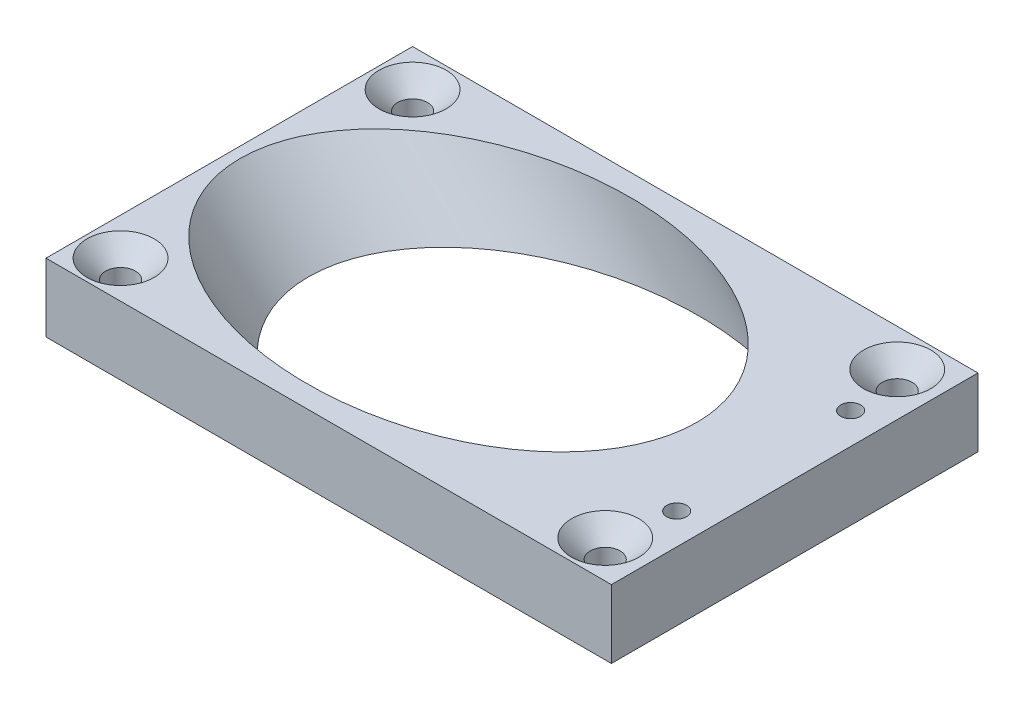
ISO-10303-21;
HEADER;
FILE_DESCRIPTION(('STEP AP214'),'2;1');
FILE_NAME('part.step','',(''),(''),'','','');
FILE_SCHEMA(('AUTOMOTIVE_DESIGN { 1 0 10303 214 1 1 1 1 }'));
ENDSEC;
DATA;
#1=APPLICATION_CONTEXT('core data for automotive mechanical design processes');
#2=APPLICATION_PROTOCOL_DEFINITION('international standard','automotive_design',2000,#1);
#3=PRODUCT_CONTEXT('',#1,'mechanical');
#4=PRODUCT('Part','Part','',(#3));
#5=PRODUCT_RELATED_PRODUCT_CATEGORY('part','',(#4));
#6=PRODUCT_DEFINITION_FORMATION('','',#4);
#7=PRODUCT_DEFINITION_CONTEXT('part definition',#1,'design');
#8=PRODUCT_DEFINITION('design','',#6,#7);
#9=PRODUCT_DEFINITION_SHAPE('','',#8);
#10=(LENGTH_UNIT() NAMED_UNIT(*) SI_UNIT(.MILLI.,.METRE.));
#11=(NAMED_UNIT(*) PLANE_ANGLE_UNIT() SI_UNIT($,.RADIAN.));
#12=(NAMED_UNIT(*) SI_UNIT($,.STERADIAN.) SOLID_ANGLE_UNIT());
#13=UNCERTAINTY_MEASURE_WITH_UNIT(LENGTH_MEASURE(1.E-05),#10,'distance_accuracy_value','');
#14=(GEOMETRIC_REPRESENTATION_CONTEXT(3) GLOBAL_UNCERTAINTY_ASSIGNED_CONTEXT((#13)) GLOBAL_UNIT_ASSIGNED_CONTEXT((#10,
#11,#12)) REPRESENTATION_CONTEXT('',''));
#15=CARTESIAN_POINT('',(0.,0.,0.));
#16=DIRECTION('',(0.,0.,1.));
#17=DIRECTION('',(1.,0.,0.));
#18=AXIS2_PLACEMENT_3D('',#15,#16,#17);
#19=CARTESIAN_POINT('',(22.75,5.5,14.75));
#20=DIRECTION('',(-1.,0.,0.));
#21=DIRECTION('',(0.,0.,1.));
#22=AXIS2_PLACEMENT_3D('',#19,#20,#21);
#23=PLANE('',#22);
#24=DIRECTION('',(0.,0.,-1.));
#25=VECTOR('',#24,1.);
#26=CARTESIAN_POINT('',(22.75,0.,14.75));
#27=LINE('',#26,#25);
#28=CARTESIAN_POINT('',(22.75,0.,14.75));
#29=VERTEX_POINT('',#28);
#30=CARTESIAN_POINT('',(22.75,0.,-14.75));
#31=VERTEX_POINT('',#30);
#32=EDGE_CURVE('E101',#29,#31,#27,.T.);
#33=ORIENTED_EDGE('',*,*,#32,.T.);
#34=DIRECTION('',(0.,-1.,0.));
#35=VECTOR('',#34,1.);
#36=CARTESIAN_POINT('',(22.75,5.5,-14.75));
#37=LINE('',#36,#35);
#38=CARTESIAN_POINT('',(22.75,5.5,-14.75));
#39=VERTEX_POINT('',#38);
#40=EDGE_CURVE('E11',#39,#31,#37,.T.);
#41=ORIENTED_EDGE('',*,*,#40,.F.);
#42=DIRECTION('',(0.,0.,-1.));
#43=VECTOR('',#42,1.);
#44=CARTESIAN_POINT('',(22.75,5.5,14.75));
#45=LINE('',#44,#43);
#46=CARTESIAN_POINT('',(22.75,5.5,14.75));
#47=VERTEX_POINT('',#46);
#48=EDGE_CURVE('E89',#47,#39,#45,.T.);
#49=ORIENTED_EDGE('',*,*,#48,.F.);
#50=DIRECTION('',(0.,-1.,0.));
#51=VECTOR('',#50,1.);
#52=CARTESIAN_POINT('',(22.75,5.5,14.75));
#53=LINE('',#52,#51);
#54=EDGE_CURVE('E97',#47,#29,#53,.T.);
#55=ORIENTED_EDGE('',*,*,#54,.T.);
#56=EDGE_LOOP('',(#33,#41,#49,#55));
#57=FACE_BOUND('',#56,.T.);
#58=ADVANCED_FACE('F38',(#57),#23,.F.);
#59=CARTESIAN_POINT('',(-22.75,5.5,-14.75));
#60=DIRECTION('',(0.,0.,1.));
#61=DIRECTION('',(1.,0.,0.));
#62=AXIS2_PLACEMENT_3D('',#59,#60,#61);
#63=PLANE('',#62);
#64=DIRECTION('',(-1.,0.,0.));
#65=VECTOR('',#64,1.);
#66=CARTESIAN_POINT('',(-22.75,0.,-14.75));
#67=LINE('',#66,#65);
#68=CARTESIAN_POINT('',(-22.75,0.,-14.75));
#69=VERTEX_POINT('',#68);
#70=EDGE_CURVE('E93',#31,#69,#67,.T.);
#71=ORIENTED_EDGE('',*,*,#70,.T.);
#72=DIRECTION('',(0.,-1.,0.));
#73=VECTOR('',#72,1.);
#74=CARTESIAN_POINT('',(-22.75,5.5,-14.75));
#75=LINE('',#74,#73);
#76=CARTESIAN_POINT('',(-22.75,5.5,-14.75));
#77=VERTEX_POINT('',#76);
#78=EDGE_CURVE('E46',#77,#69,#75,.T.);
#79=ORIENTED_EDGE('',*,*,#78,.F.);
#80=DIRECTION('',(-1.,0.,0.));
#81=VECTOR('',#80,1.);
#82=CARTESIAN_POINT('',(-22.75,5.5,-14.75));
#83=LINE('',#82,#81);
#84=EDGE_CURVE('E84',#39,#77,#83,.T.);
#85=ORIENTED_EDGE('',*,*,#84,.F.);
#86=ORIENTED_EDGE('',*,*,#40,.T.);
#87=EDGE_LOOP('',(#71,#79,#85,#86));
#88=FACE_BOUND('',#87,.T.);
#89=ADVANCED_FACE('F92',(#88),#63,.F.);
#90=CARTESIAN_POINT('',(-22.75,5.5,14.75));
#91=DIRECTION('',(1.,0.,0.));
#92=DIRECTION('',(0.,0.,-1.));
#93=AXIS2_PLACEMENT_3D('',#90,#91,#92);
#94=PLANE('',#93);
#95=DIRECTION('',(0.,0.,1.));
#96=VECTOR('',#95,1.);
#97=CARTESIAN_POINT('',(-22.75,0.,14.75));
#98=LINE('',#97,#96);
#99=CARTESIAN_POINT('',(-22.75,0.,14.75));
#100=VERTEX_POINT('',#99);
#101=EDGE_CURVE('E71',#69,#100,#98,.T.);
#102=ORIENTED_EDGE('',*,*,#101,.T.);
#103=DIRECTION('',(0.,-1.,0.));
#104=VECTOR('',#103,1.);
#105=CARTESIAN_POINT('',(-22.75,5.5,14.75));
#106=LINE('',#105,#104);
#107=CARTESIAN_POINT('',(-22.75,5.5,14.75));
#108=VERTEX_POINT('',#107);
#109=EDGE_CURVE('E94',#108,#100,#106,.T.);
#110=ORIENTED_EDGE('',*,*,#109,.F.);
#111=DIRECTION('',(0.,0.,1.));
#112=VECTOR('',#111,1.);
#113=CARTESIAN_POINT('',(-22.75,5.5,14.75));
#114=LINE('',#113,#112);
#115=EDGE_CURVE('E87',#77,#108,#114,.T.);
#116=ORIENTED_EDGE('',*,*,#115,.F.);
#117=ORIENTED_EDGE('',*,*,#78,.T.);
#118=EDGE_LOOP('',(#102,#110,#116,#117));
#119=FACE_BOUND('',#118,.T.);
#120=ADVANCED_FACE('F95',(#119),#94,.F.);
#121=CARTESIAN_POINT('',(-22.75,5.5,14.75));
#122=DIRECTION('',(0.,0.,-1.));
#123=DIRECTION('',(-1.,0.,0.));
#124=AXIS2_PLACEMENT_3D('',#121,#122,#123);
#125=PLANE('',#124);
#126=DIRECTION('',(1.,0.,0.));
#127=VECTOR('',#126,1.);
#128=CARTESIAN_POINT('',(-22.75,0.,14.75));
#129=LINE('',#128,#127);
#130=EDGE_CURVE('E77',#100,#29,#129,.T.);
#131=ORIENTED_EDGE('',*,*,#130,.T.);
#132=ORIENTED_EDGE('',*,*,#54,.F.);
#133=DIRECTION('',(1.,0.,0.));
#134=VECTOR('',#133,1.);
#135=CARTESIAN_POINT('',(-22.75,5.5,14.75));
#136=LINE('',#135,#134);
#137=EDGE_CURVE('E54',#108,#47,#136,.T.);
#138=ORIENTED_EDGE('',*,*,#137,.F.);
#139=ORIENTED_EDGE('',*,*,#109,.T.);
#140=EDGE_LOOP('',(#131,#132,#138,#139));
#141=FACE_BOUND('',#140,.T.);
#142=ADVANCED_FACE('F109',(#141),#125,.F.);
#143=CARTESIAN_POINT('',(0.,5.5,0.));
#144=DIRECTION('',(0.,-1.,0.));
#145=DIRECTION('',(0.,0.,-1.));
#146=AXIS2_PLACEMENT_3D('',#143,#144,#145);
#147=PLANE('',#146);
#148=CARTESIAN_POINT('',(20.25,5.5,-7.));
#149=DIRECTION('',(0.,1.,0.));
#150=DIRECTION('',(0.,0.,1.));
#151=AXIS2_PLACEMENT_3D('',#148,#149,#150);
#152=CIRCLE('',#151,0.799999999999988);
#153=CARTESIAN_POINT('',(20.25,5.5,-6.20000000000001));
#154=VERTEX_POINT('',#153);
#155=EDGE_CURVE('E165',#154,#154,#152,.T.);
#156=ORIENTED_EDGE('',*,*,#155,.F.);
#157=EDGE_LOOP('',(#156));
#158=FACE_BOUND('',#157,.T.);
#159=CARTESIAN_POINT('',(20.25,5.5,7.));
#160=DIRECTION('',(0.,1.,0.));
#161=DIRECTION('',(0.,0.,1.));
#162=AXIS2_PLACEMENT_3D('',#159,#160,#161);
#163=CIRCLE('',#162,0.799999999999988);
#164=CARTESIAN_POINT('',(20.25,5.5,7.79999999999999));
#165=VERTEX_POINT('',#164);
#166=EDGE_CURVE('E159',#165,#165,#163,.T.);
#167=ORIENTED_EDGE('',*,*,#166,.F.);
#168=EDGE_LOOP('',(#167));
#169=FACE_BOUND('',#168,.T.);
#170=CARTESIAN_POINT('',(-19.75,5.5,-11.75));
#171=DIRECTION('',(0.,1.,0.));
#172=DIRECTION('',(0.,0.,1.));
#173=AXIS2_PLACEMENT_3D('',#170,#171,#172);
#174=CIRCLE('',#173,2.7);
#175=CARTESIAN_POINT('',(-19.75,5.5,-9.05));
#176=VERTEX_POINT('',#175);
#177=EDGE_CURVE('E153',#176,#176,#174,.T.);
#178=ORIENTED_EDGE('',*,*,#177,.F.);
#179=EDGE_LOOP('',(#178));
#180=FACE_BOUND('',#179,.T.);
#181=CARTESIAN_POINT('',(19.25,5.5,-11.75));
#182=DIRECTION('',(0.,1.,0.));
#183=DIRECTION('',(0.,0.,1.));
#184=AXIS2_PLACEMENT_3D('',#181,#182,#183);
#185=CIRCLE('',#184,2.7);
#186=CARTESIAN_POINT('',(19.25,5.5,-9.05));
#187=VERTEX_POINT('',#186);
#188=EDGE_CURVE('E144',#187,#187,#185,.T.);
#189=ORIENTED_EDGE('',*,*,#188,.F.);
#190=EDGE_LOOP('',(#189));
#191=FACE_BOUND('',#190,.T.);
#192=CARTESIAN_POINT('',(-19.75,5.5,11.75));
#193=DIRECTION('',(0.,1.,0.));
#194=DIRECTION('',(0.,0.,1.));
#195=AXIS2_PLACEMENT_3D('',#192,#193,#194);
#196=CIRCLE('',#195,2.7);
#197=CARTESIAN_POINT('',(-19.75,5.5,14.45));
#198=VERTEX_POINT('',#197);
#199=EDGE_CURVE('E135',#198,#198,#196,.T.);
#200=ORIENTED_EDGE('',*,*,#199,.F.);
#201=EDGE_LOOP('',(#200));
#202=FACE_BOUND('',#201,.T.);
#203=CARTESIAN_POINT('',(19.25,5.5,11.75));
#204=DIRECTION('',(0.,1.,0.));
#205=DIRECTION('',(0.,0.,1.));
#206=AXIS2_PLACEMENT_3D('',#203,#204,#205);
#207=CIRCLE('',#206,2.7);
#208=CARTESIAN_POINT('',(19.25,5.5,14.45));
#209=VERTEX_POINT('',#208);
#210=EDGE_CURVE('E126',#209,#209,#207,.T.);
#211=ORIENTED_EDGE('',*,*,#210,.F.);
#212=EDGE_LOOP('',(#211));
#213=FACE_BOUND('',#212,.T.);
#214=CARTESIAN_POINT('',(-3.50126265847082,5.5,0.));
#215=DIRECTION('',(0.,-1.,0.));
#216=DIRECTION('',(-1.,0.,0.));
#217=AXIS2_PLACEMENT_3D('',#214,#215,#216);
#218=ELLIPSE('',#217,18.3847763108503,13.);
#219=CARTESIAN_POINT('',(-21.8860389693211,5.5,0.));
#220=VERTEX_POINT('',#219);
#221=EDGE_CURVE('E104',#220,#220,#218,.F.);
#222=ORIENTED_EDGE('',*,*,#221,.F.);
#223=EDGE_LOOP('',(#222));
#224=FACE_BOUND('',#223,.T.);
#225=ORIENTED_EDGE('',*,*,#48,.T.);
#226=ORIENTED_EDGE('',*,*,#84,.T.);
#227=ORIENTED_EDGE('',*,*,#115,.T.);
#228=ORIENTED_EDGE('',*,*,#137,.T.);
#229=EDGE_LOOP('',(#225,#226,#227,#228));
#230=FACE_BOUND('',#229,.T.);
#231=ADVANCED_FACE('F85',(#158,#169,#180,#191,#202,#213,#224,#230),#147,.F.);
#232=CARTESIAN_POINT('',(0.,0.,0.));
#233=DIRECTION('',(0.,-1.,0.));
#234=DIRECTION('',(0.,0.,-1.));
#235=AXIS2_PLACEMENT_3D('',#232,#233,#234);
#236=PLANE('',#235);
#237=CARTESIAN_POINT('',(20.25,0.,-7.));
#238=DIRECTION('',(0.,1.,0.));
#239=DIRECTION('',(0.,0.,1.));
#240=AXIS2_PLACEMENT_3D('',#237,#238,#239);
#241=CIRCLE('',#240,0.799999999999995);
#242=CARTESIAN_POINT('',(20.25,0.,-6.2));
#243=VERTEX_POINT('',#242);
#244=EDGE_CURVE('E162',#243,#243,#241,.T.);
#245=ORIENTED_EDGE('',*,*,#244,.T.);
#246=EDGE_LOOP('',(#245));
#247=FACE_BOUND('',#246,.T.);
#248=CARTESIAN_POINT('',(20.25,0.,7.));
#249=DIRECTION('',(0.,1.,0.));
#250=DIRECTION('',(0.,0.,1.));
#251=AXIS2_PLACEMENT_3D('',#248,#249,#250);
#252=CIRCLE('',#251,0.799999999999995);
#253=CARTESIAN_POINT('',(20.25,0.,7.8));
#254=VERTEX_POINT('',#253);
#255=EDGE_CURVE('E156',#254,#254,#252,.T.);
#256=ORIENTED_EDGE('',*,*,#255,.T.);
#257=EDGE_LOOP('',(#256));
#258=FACE_BOUND('',#257,.T.);
#259=CARTESIAN_POINT('',(-19.75,0.,-11.75));
#260=DIRECTION('',(0.,1.,0.));
#261=DIRECTION('',(0.,0.,1.));
#262=AXIS2_PLACEMENT_3D('',#259,#260,#261);
#263=CIRCLE('',#262,1.2);
#264=CARTESIAN_POINT('',(-19.75,0.,-10.55));
#265=VERTEX_POINT('',#264);
#266=EDGE_CURVE('E147',#265,#265,#263,.T.);
#267=ORIENTED_EDGE('',*,*,#266,.T.);
#268=EDGE_LOOP('',(#267));
#269=FACE_BOUND('',#268,.T.);
#270=CARTESIAN_POINT('',(19.25,0.,-11.75));
#271=DIRECTION('',(0.,1.,0.));
#272=DIRECTION('',(0.,0.,1.));
#273=AXIS2_PLACEMENT_3D('',#270,#271,#272);
#274=CIRCLE('',#273,1.2);
#275=CARTESIAN_POINT('',(19.25,0.,-10.55));
#276=VERTEX_POINT('',#275);
#277=EDGE_CURVE('E138',#276,#276,#274,.T.);
#278=ORIENTED_EDGE('',*,*,#277,.T.);
#279=EDGE_LOOP('',(#278));
#280=FACE_BOUND('',#279,.T.);
#281=CARTESIAN_POINT('',(-19.75,0.,11.75));
#282=DIRECTION('',(0.,1.,0.));
#283=DIRECTION('',(0.,0.,1.));
#284=AXIS2_PLACEMENT_3D('',#281,#282,#283);
#285=CIRCLE('',#284,1.2);
#286=CARTESIAN_POINT('',(-19.75,0.,12.95));
#287=VERTEX_POINT('',#286);
#288=EDGE_CURVE('E129',#287,#287,#285,.T.);
#289=ORIENTED_EDGE('',*,*,#288,.T.);
#290=EDGE_LOOP('',(#289));
#291=FACE_BOUND('',#290,.T.);
#292=CARTESIAN_POINT('',(19.25,0.,11.75));
#293=DIRECTION('',(0.,1.,0.));
#294=DIRECTION('',(0.,0.,1.));
#295=AXIS2_PLACEMENT_3D('',#292,#293,#294);
#296=CIRCLE('',#295,1.2);
#297=CARTESIAN_POINT('',(19.25,0.,12.95));
#298=VERTEX_POINT('',#297);
#299=EDGE_CURVE('E120',#298,#298,#296,.T.);
#300=ORIENTED_EDGE('',*,*,#299,.T.);
#301=EDGE_LOOP('',(#300));
#302=FACE_BOUND('',#301,.T.);
#303=CARTESIAN_POINT('',(1.9987373415292,0.,0.));
#304=DIRECTION('',(0.,-1.,0.));
#305=DIRECTION('',(-1.,0.,0.));
#306=AXIS2_PLACEMENT_3D('',#303,#304,#305);
#307=ELLIPSE('',#306,18.3847763108503,13.);
#308=CARTESIAN_POINT('',(-16.3860389693211,0.,0.));
#309=VERTEX_POINT('',#308);
#310=EDGE_CURVE('E117',#309,#309,#307,.F.);
#311=ORIENTED_EDGE('',*,*,#310,.T.);
#312=EDGE_LOOP('',(#311));
#313=FACE_BOUND('',#312,.T.);
#314=ORIENTED_EDGE('',*,*,#32,.F.);
#315=ORIENTED_EDGE('',*,*,#130,.F.);
#316=ORIENTED_EDGE('',*,*,#101,.F.);
#317=ORIENTED_EDGE('',*,*,#70,.F.);
#318=EDGE_LOOP('',(#314,#315,#316,#317));
#319=FACE_BOUND('',#318,.T.);
#320=ADVANCED_FACE('F112',(#247,#258,#269,#280,#291,#302,#313,#319),#236,.T.);
#321=CARTESIAN_POINT('',(12.3753686707646,-10.3766313292354,0.));
#322=DIRECTION('',(-0.707106781186549,0.707106781186546,0.));
#323=DIRECTION('',(-0.707106781186546,-0.707106781186549,0.));
#324=AXIS2_PLACEMENT_3D('',#321,#322,#323);
#325=CYLINDRICAL_SURFACE('',#324,13.);
#326=ORIENTED_EDGE('',*,*,#310,.F.);
#327=EDGE_LOOP('',(#326));
#328=FACE_BOUND('',#327,.T.);
#329=ORIENTED_EDGE('',*,*,#221,.T.);
#330=EDGE_LOOP('',(#329));
#331=FACE_BOUND('',#330,.T.);
#332=ADVANCED_FACE('F186',(#328,#331),#325,.F.);
#333=CARTESIAN_POINT('',(19.25,5.5,11.75));
#334=DIRECTION('',(0.,1.,0.));
#335=DIRECTION('',(0.,0.,1.));
#336=AXIS2_PLACEMENT_3D('',#333,#334,#335);
#337=CYLINDRICAL_SURFACE('',#336,1.19999999999999);
#338=ORIENTED_EDGE('',*,*,#299,.F.);
#339=EDGE_LOOP('',(#338));
#340=FACE_BOUND('',#339,.T.);
#341=CARTESIAN_POINT('',(19.25,4.,11.75));
#342=DIRECTION('',(0.,1.,0.));
#343=DIRECTION('',(0.,0.,1.));
#344=AXIS2_PLACEMENT_3D('',#341,#342,#343);
#345=CIRCLE('',#344,1.19999999999999);
#346=CARTESIAN_POINT('',(19.25,4.,12.95));
#347=VERTEX_POINT('',#346);
#348=EDGE_CURVE('E123',#347,#347,#345,.T.);
#349=ORIENTED_EDGE('',*,*,#348,.T.);
#350=EDGE_LOOP('',(#349));
#351=FACE_BOUND('',#350,.T.);
#352=ADVANCED_FACE('F188',(#340,#351),#337,.F.);
#353=CARTESIAN_POINT('',(19.25,5.5,11.75));
#354=DIRECTION('',(0.,1.,0.));
#355=DIRECTION('',(0.,0.,1.));
#356=AXIS2_PLACEMENT_3D('',#353,#354,#355);
#357=CONICAL_SURFACE('',#356,2.7,0.785398163397452);
#358=ORIENTED_EDGE('',*,*,#348,.F.);
#359=EDGE_LOOP('',(#358));
#360=FACE_BOUND('',#359,.T.);
#361=ORIENTED_EDGE('',*,*,#210,.T.);
#362=EDGE_LOOP('',(#361));
#363=FACE_BOUND('',#362,.T.);
#364=ADVANCED_FACE('F195',(#360,#363),#357,.F.);
#365=CARTESIAN_POINT('',(-19.75,5.5,11.75));
#366=DIRECTION('',(0.,1.,0.));
#367=DIRECTION('',(0.,0.,1.));
#368=AXIS2_PLACEMENT_3D('',#365,#366,#367);
#369=CYLINDRICAL_SURFACE('',#368,1.19999999999999);
#370=ORIENTED_EDGE('',*,*,#288,.F.);
#371=EDGE_LOOP('',(#370));
#372=FACE_BOUND('',#371,.T.);
#373=CARTESIAN_POINT('',(-19.75,4.,11.75));
#374=DIRECTION('',(0.,1.,0.));
#375=DIRECTION('',(0.,0.,1.));
#376=AXIS2_PLACEMENT_3D('',#373,#374,#375);
#377=CIRCLE('',#376,1.19999999999999);
#378=CARTESIAN_POINT('',(-19.75,4.,12.95));
#379=VERTEX_POINT('',#378);
#380=EDGE_CURVE('E132',#379,#379,#377,.T.);
#381=ORIENTED_EDGE('',*,*,#380,.T.);
#382=EDGE_LOOP('',(#381));
#383=FACE_BOUND('',#382,.T.);
#384=ADVANCED_FACE('F288',(#372,#383),#369,.F.);
#385=CARTESIAN_POINT('',(-19.75,5.5,11.75));
#386=DIRECTION('',(0.,1.,0.));
#387=DIRECTION('',(0.,0.,1.));
#388=AXIS2_PLACEMENT_3D('',#385,#386,#387);
#389=CONICAL_SURFACE('',#388,2.7,0.785398163397452);
#390=ORIENTED_EDGE('',*,*,#380,.F.);
#391=EDGE_LOOP('',(#390));
#392=FACE_BOUND('',#391,.T.);
#393=ORIENTED_EDGE('',*,*,#199,.T.);
#394=EDGE_LOOP('',(#393));
#395=FACE_BOUND('',#394,.T.);
#396=ADVANCED_FACE('F280',(#392,#395),#389,.F.);
#397=CARTESIAN_POINT('',(19.25,5.5,-11.75));
#398=DIRECTION('',(0.,1.,0.));
#399=DIRECTION('',(0.,0.,1.));
#400=AXIS2_PLACEMENT_3D('',#397,#398,#399);
#401=CYLINDRICAL_SURFACE('',#400,1.19999999999999);
#402=ORIENTED_EDGE('',*,*,#277,.F.);
#403=EDGE_LOOP('',(#402));
#404=FACE_BOUND('',#403,.T.);
#405=CARTESIAN_POINT('',(19.25,4.,-11.75));
#406=DIRECTION('',(0.,1.,0.));
#407=DIRECTION('',(0.,0.,1.));
#408=AXIS2_PLACEMENT_3D('',#405,#406,#407);
#409=CIRCLE('',#408,1.19999999999999);
#410=CARTESIAN_POINT('',(19.25,4.,-10.55));
#411=VERTEX_POINT('',#410);
#412=EDGE_CURVE('E141',#411,#411,#409,.T.);
#413=ORIENTED_EDGE('',*,*,#412,.T.);
#414=EDGE_LOOP('',(#413));
#415=FACE_BOUND('',#414,.T.);
#416=ADVANCED_FACE('F272',(#404,#415),#401,.F.);
#417=CARTESIAN_POINT('',(19.25,5.5,-11.75));
#418=DIRECTION('',(0.,1.,0.));
#419=DIRECTION('',(0.,0.,1.));
#420=AXIS2_PLACEMENT_3D('',#417,#418,#419);
#421=CONICAL_SURFACE('',#420,2.7,0.785398163397452);
#422=ORIENTED_EDGE('',*,*,#412,.F.);
#423=EDGE_LOOP('',(#422));
#424=FACE_BOUND('',#423,.T.);
#425=ORIENTED_EDGE('',*,*,#188,.T.);
#426=EDGE_LOOP('',(#425));
#427=FACE_BOUND('',#426,.T.);
#428=ADVANCED_FACE('F264',(#424,#427),#421,.F.);
#429=CARTESIAN_POINT('',(-19.75,5.5,-11.75));
#430=DIRECTION('',(0.,1.,0.));
#431=DIRECTION('',(0.,0.,1.));
#432=AXIS2_PLACEMENT_3D('',#429,#430,#431);
#433=CYLINDRICAL_SURFACE('',#432,1.19999999999999);
#434=ORIENTED_EDGE('',*,*,#266,.F.);
#435=EDGE_LOOP('',(#434));
#436=FACE_BOUND('',#435,.T.);
#437=CARTESIAN_POINT('',(-19.75,4.,-11.75));
#438=DIRECTION('',(0.,1.,0.));
#439=DIRECTION('',(0.,0.,1.));
#440=AXIS2_PLACEMENT_3D('',#437,#438,#439);
#441=CIRCLE('',#440,1.19999999999999);
#442=CARTESIAN_POINT('',(-19.75,4.,-10.55));
#443=VERTEX_POINT('',#442);
#444=EDGE_CURVE('E150',#443,#443,#441,.T.);
#445=ORIENTED_EDGE('',*,*,#444,.T.);
#446=EDGE_LOOP('',(#445));
#447=FACE_BOUND('',#446,.T.);
#448=ADVANCED_FACE('F257',(#436,#447),#433,.F.);
#449=CARTESIAN_POINT('',(-19.75,5.5,-11.75));
#450=DIRECTION('',(0.,1.,0.));
#451=DIRECTION('',(0.,0.,1.));
#452=AXIS2_PLACEMENT_3D('',#449,#450,#451);
#453=CONICAL_SURFACE('',#452,2.7,0.785398163397452);
#454=ORIENTED_EDGE('',*,*,#444,.F.);
#455=EDGE_LOOP('',(#454));
#456=FACE_BOUND('',#455,.T.);
#457=ORIENTED_EDGE('',*,*,#177,.T.);
#458=EDGE_LOOP('',(#457));
#459=FACE_BOUND('',#458,.T.);
#460=ADVANCED_FACE('F236',(#456,#459),#453,.F.);
#461=CARTESIAN_POINT('',(20.25,5.5,7.));
#462=DIRECTION('',(0.,1.,0.));
#463=DIRECTION('',(0.,0.,1.));
#464=AXIS2_PLACEMENT_3D('',#461,#462,#463);
#465=CYLINDRICAL_SURFACE('',#464,0.799999999999992);
#466=ORIENTED_EDGE('',*,*,#255,.F.);
#467=EDGE_LOOP('',(#466));
#468=FACE_BOUND('',#467,.T.);
#469=ORIENTED_EDGE('',*,*,#166,.T.);
#470=EDGE_LOOP('',(#469));
#471=FACE_BOUND('',#470,.T.);
#472=ADVANCED_FACE('F230',(#468,#471),#465,.F.);
#473=CARTESIAN_POINT('',(20.25,5.5,-7.));
#474=DIRECTION('',(0.,1.,0.));
#475=DIRECTION('',(0.,0.,1.));
#476=AXIS2_PLACEMENT_3D('',#473,#474,#475);
#477=CYLINDRICAL_SURFACE('',#476,0.799999999999992);
#478=ORIENTED_EDGE('',*,*,#244,.F.);
#479=EDGE_LOOP('',(#478));
#480=FACE_BOUND('',#479,.T.);
#481=ORIENTED_EDGE('',*,*,#155,.T.);
#482=EDGE_LOOP('',(#481));
#483=FACE_BOUND('',#482,.T.);
#484=ADVANCED_FACE('F169',(#480,#483),#477,.F.);
#485=CLOSED_SHELL('',(#58,#89,#120,#142,#231,#320,#332,#352,#364,#384,#396,#416,#428,#448,#460,
#472,#484));
#486=MANIFOLD_SOLID_BREP('B2',#485);
#487=ADVANCED_BREP_SHAPE_REPRESENTATION('',(#18,#486),#14);
#488=SHAPE_DEFINITION_REPRESENTATION(#9,#487);
ENDSEC;
END-ISO-10303-21;
